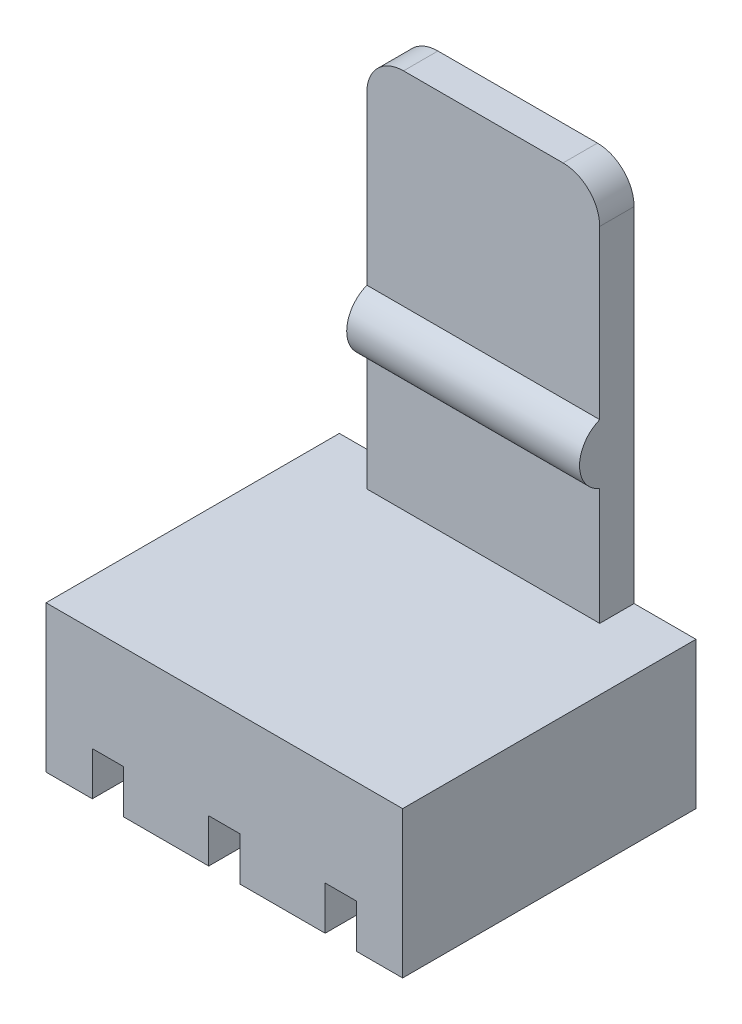
ISO-10303-21;
HEADER;
FILE_DESCRIPTION(('STEP AP214'),'2;1');
FILE_NAME('part.step','',(''),(''),'','','');
FILE_SCHEMA(('AUTOMOTIVE_DESIGN { 1 0 10303 214 1 1 1 1 }'));
ENDSEC;
DATA;
#1=APPLICATION_CONTEXT('core data for automotive mechanical design processes');
#2=APPLICATION_PROTOCOL_DEFINITION('international standard','automotive_design',2000,#1);
#3=PRODUCT_CONTEXT('',#1,'mechanical');
#4=PRODUCT('Part','Part','',(#3));
#5=PRODUCT_RELATED_PRODUCT_CATEGORY('part','',(#4));
#6=PRODUCT_DEFINITION_FORMATION('','',#4);
#7=PRODUCT_DEFINITION_CONTEXT('part definition',#1,'design');
#8=PRODUCT_DEFINITION('design','',#6,#7);
#9=PRODUCT_DEFINITION_SHAPE('','',#8);
#10=(LENGTH_UNIT() NAMED_UNIT(*) SI_UNIT(.MILLI.,.METRE.));
#11=(NAMED_UNIT(*) PLANE_ANGLE_UNIT() SI_UNIT($,.RADIAN.));
#12=(NAMED_UNIT(*) SI_UNIT($,.STERADIAN.) SOLID_ANGLE_UNIT());
#13=UNCERTAINTY_MEASURE_WITH_UNIT(LENGTH_MEASURE(1.E-05),#10,'distance_accuracy_value','');
#14=(GEOMETRIC_REPRESENTATION_CONTEXT(3) GLOBAL_UNCERTAINTY_ASSIGNED_CONTEXT((#13)) GLOBAL_UNIT_ASSIGNED_CONTEXT((#10,
#11,#12)) REPRESENTATION_CONTEXT('',''));
#15=CARTESIAN_POINT('',(0.,0.,0.));
#16=DIRECTION('',(0.,0.,1.));
#17=DIRECTION('',(1.,0.,0.));
#18=AXIS2_PLACEMENT_3D('',#15,#16,#17);
#19=CARTESIAN_POINT('',(-2.88,0.,-3.2));
#20=DIRECTION('',(-1.,0.,0.));
#21=DIRECTION('',(0.,0.,1.));
#22=AXIS2_PLACEMENT_3D('',#19,#20,#21);
#23=PLANE('',#22);
#24=DIRECTION('',(0.,1.,0.));
#25=VECTOR('',#24,1.);
#26=CARTESIAN_POINT('',(-2.88,0.,-3.2));
#27=LINE('',#26,#25);
#28=CARTESIAN_POINT('',(-2.88,0.95,-3.2));
#29=VERTEX_POINT('',#28);
#30=CARTESIAN_POINT('',(-2.88,0.,-3.2));
#31=VERTEX_POINT('',#30);
#32=EDGE_CURVE('E187',#29,#31,#27,.F.);
#33=ORIENTED_EDGE('',*,*,#32,.F.);
#34=DIRECTION('',(0.,0.,1.));
#35=VECTOR('',#34,1.);
#36=CARTESIAN_POINT('',(-2.88,0.95,0.));
#37=LINE('',#36,#35);
#38=CARTESIAN_POINT('',(-2.88,0.95,3.2));
#39=VERTEX_POINT('',#38);
#40=EDGE_CURVE('E290',#29,#39,#37,.T.);
#41=ORIENTED_EDGE('',*,*,#40,.T.);
#42=DIRECTION('',(0.,1.,0.));
#43=VECTOR('',#42,1.);
#44=CARTESIAN_POINT('',(-2.88,0.,3.2));
#45=LINE('',#44,#43);
#46=CARTESIAN_POINT('',(-2.88,0.,3.2));
#47=VERTEX_POINT('',#46);
#48=EDGE_CURVE('E333',#47,#39,#45,.T.);
#49=ORIENTED_EDGE('',*,*,#48,.F.);
#50=DIRECTION('',(0.,0.,1.));
#51=VECTOR('',#50,1.);
#52=CARTESIAN_POINT('',(-2.88,0.,0.));
#53=LINE('',#52,#51);
#54=EDGE_CURVE('E195',#47,#31,#53,.F.);
#55=ORIENTED_EDGE('',*,*,#54,.T.);
#56=EDGE_LOOP('',(#33,#41,#49,#55));
#57=FACE_BOUND('',#56,.T.);
#58=ADVANCED_FACE('F17',(#57),#23,.F.);
#59=CARTESIAN_POINT('',(1.27,6.4,-2.70980762113533));
#60=DIRECTION('',(1.,0.,0.));
#61=DIRECTION('',(0.,1.,0.));
#62=AXIS2_PLACEMENT_3D('',#59,#60,#61);
#63=CYLINDRICAL_SURFACE('',#62,0.7);
#64=CARTESIAN_POINT('',(2.54,6.4,-2.70980762113533));
#65=DIRECTION('',(1.,0.,0.));
#66=DIRECTION('',(0.,1.,0.));
#67=AXIS2_PLACEMENT_3D('',#64,#65,#66);
#68=CIRCLE('',#67,0.7);
#69=CARTESIAN_POINT('',(2.54,5.75,-2.45));
#70=VERTEX_POINT('',#69);
#71=CARTESIAN_POINT('',(2.54,7.05,-2.45));
#72=VERTEX_POINT('',#71);
#73=EDGE_CURVE('E186',#70,#72,#68,.F.);
#74=ORIENTED_EDGE('',*,*,#73,.T.);
#75=DIRECTION('',(1.,0.,0.));
#76=VECTOR('',#75,1.);
#77=CARTESIAN_POINT('',(0.,7.05,-2.45));
#78=LINE('',#77,#76);
#79=CARTESIAN_POINT('',(-2.54,7.05,-2.45));
#80=VERTEX_POINT('',#79);
#81=EDGE_CURVE('E184',#80,#72,#78,.T.);
#82=ORIENTED_EDGE('',*,*,#81,.F.);
#83=CARTESIAN_POINT('',(-2.54,6.4,-2.70980762113533));
#84=DIRECTION('',(1.,0.,0.));
#85=DIRECTION('',(0.,1.,0.));
#86=AXIS2_PLACEMENT_3D('',#83,#84,#85);
#87=CIRCLE('',#86,0.7);
#88=CARTESIAN_POINT('',(-2.54,5.75,-2.45));
#89=VERTEX_POINT('',#88);
#90=EDGE_CURVE('E20',#80,#89,#87,.T.);
#91=ORIENTED_EDGE('',*,*,#90,.T.);
#92=DIRECTION('',(1.,0.,0.));
#93=VECTOR('',#92,1.);
#94=CARTESIAN_POINT('',(0.,5.75,-2.45));
#95=LINE('',#94,#93);
#96=EDGE_CURVE('E181',#70,#89,#95,.F.);
#97=ORIENTED_EDGE('',*,*,#96,.F.);
#98=EDGE_LOOP('',(#74,#82,#91,#97));
#99=FACE_BOUND('',#98,.T.);
#100=ADVANCED_FACE('F180',(#99),#63,.T.);
#101=CARTESIAN_POINT('',(2.88,0.,3.2));
#102=DIRECTION('',(1.,0.,0.));
#103=DIRECTION('',(0.,0.,-1.));
#104=AXIS2_PLACEMENT_3D('',#101,#102,#103);
#105=PLANE('',#104);
#106=DIRECTION('',(0.,1.,0.));
#107=VECTOR('',#106,1.);
#108=CARTESIAN_POINT('',(2.88,0.,3.2));
#109=LINE('',#108,#107);
#110=CARTESIAN_POINT('',(2.88,0.95,3.2));
#111=VERTEX_POINT('',#110);
#112=CARTESIAN_POINT('',(2.88,0.,3.2));
#113=VERTEX_POINT('',#112);
#114=EDGE_CURVE('E304',#111,#113,#109,.F.);
#115=ORIENTED_EDGE('',*,*,#114,.F.);
#116=DIRECTION('',(0.,0.,1.));
#117=VECTOR('',#116,1.);
#118=CARTESIAN_POINT('',(2.88,0.95,0.));
#119=LINE('',#118,#117);
#120=CARTESIAN_POINT('',(2.88,0.95,-3.2));
#121=VERTEX_POINT('',#120);
#122=EDGE_CURVE('E297',#111,#121,#119,.F.);
#123=ORIENTED_EDGE('',*,*,#122,.T.);
#124=DIRECTION('',(0.,1.,0.));
#125=VECTOR('',#124,1.);
#126=CARTESIAN_POINT('',(2.88,0.,-3.2));
#127=LINE('',#126,#125);
#128=CARTESIAN_POINT('',(2.88,0.,-3.2));
#129=VERTEX_POINT('',#128);
#130=EDGE_CURVE('E330',#129,#121,#127,.T.);
#131=ORIENTED_EDGE('',*,*,#130,.F.);
#132=DIRECTION('',(0.,0.,1.));
#133=VECTOR('',#132,1.);
#134=CARTESIAN_POINT('',(2.88,0.,0.));
#135=LINE('',#134,#133);
#136=EDGE_CURVE('E264',#129,#113,#135,.T.);
#137=ORIENTED_EDGE('',*,*,#136,.T.);
#138=EDGE_LOOP('',(#115,#123,#131,#137));
#139=FACE_BOUND('',#138,.T.);
#140=ADVANCED_FACE('F416',(#139),#105,.F.);
#141=CARTESIAN_POINT('',(2.54,0.95,0.));
#142=DIRECTION('',(0.,1.,0.));
#143=DIRECTION('',(0.,0.,1.));
#144=AXIS2_PLACEMENT_3D('',#141,#142,#143);
#145=PLANE('',#144);
#146=DIRECTION('',(1.,0.,0.));
#147=VECTOR('',#146,1.);
#148=CARTESIAN_POINT('',(2.54,0.95,3.2));
#149=LINE('',#148,#147);
#150=CARTESIAN_POINT('',(2.2,0.95,3.2));
#151=VERTEX_POINT('',#150);
#152=EDGE_CURVE('E300',#151,#111,#149,.T.);
#153=ORIENTED_EDGE('',*,*,#152,.F.);
#154=DIRECTION('',(0.,0.,1.));
#155=VECTOR('',#154,1.);
#156=CARTESIAN_POINT('',(2.2,0.95,-3.2));
#157=LINE('',#156,#155);
#158=CARTESIAN_POINT('',(2.2,0.95,-3.2));
#159=VERTEX_POINT('',#158);
#160=EDGE_CURVE('E260',#151,#159,#157,.F.);
#161=ORIENTED_EDGE('',*,*,#160,.T.);
#162=DIRECTION('',(1.,0.,0.));
#163=VECTOR('',#162,1.);
#164=CARTESIAN_POINT('',(2.54,0.95,-3.2));
#165=LINE('',#164,#163);
#166=EDGE_CURVE('E302',#121,#159,#165,.F.);
#167=ORIENTED_EDGE('',*,*,#166,.F.);
#168=ORIENTED_EDGE('',*,*,#122,.F.);
#169=EDGE_LOOP('',(#153,#161,#167,#168));
#170=FACE_BOUND('',#169,.T.);
#171=ADVANCED_FACE('F420',(#170),#145,.F.);
#172=CARTESIAN_POINT('',(0.,0.95,0.));
#173=DIRECTION('',(0.,1.,0.));
#174=DIRECTION('',(0.,0.,1.));
#175=AXIS2_PLACEMENT_3D('',#172,#173,#174);
#176=PLANE('',#175);
#177=DIRECTION('',(0.,0.,-1.));
#178=VECTOR('',#177,1.);
#179=CARTESIAN_POINT('',(0.34,0.95,3.2));
#180=LINE('',#179,#178);
#181=CARTESIAN_POINT('',(0.34,0.95,-3.2));
#182=VERTEX_POINT('',#181);
#183=CARTESIAN_POINT('',(0.34,0.95,3.2));
#184=VERTEX_POINT('',#183);
#185=EDGE_CURVE('E254',#182,#184,#180,.F.);
#186=ORIENTED_EDGE('',*,*,#185,.T.);
#187=DIRECTION('',(1.,0.,0.));
#188=VECTOR('',#187,1.);
#189=CARTESIAN_POINT('',(-3.89,0.95,3.2));
#190=LINE('',#189,#188);
#191=CARTESIAN_POINT('',(-0.34,0.95,3.2));
#192=VERTEX_POINT('',#191);
#193=EDGE_CURVE('E248',#192,#184,#190,.T.);
#194=ORIENTED_EDGE('',*,*,#193,.F.);
#195=DIRECTION('',(0.,0.,1.));
#196=VECTOR('',#195,1.);
#197=CARTESIAN_POINT('',(-0.34,0.95,-3.2));
#198=LINE('',#197,#196);
#199=CARTESIAN_POINT('',(-0.34,0.95,-3.2));
#200=VERTEX_POINT('',#199);
#201=EDGE_CURVE('E229',#192,#200,#198,.F.);
#202=ORIENTED_EDGE('',*,*,#201,.T.);
#203=DIRECTION('',(1.,0.,0.));
#204=VECTOR('',#203,1.);
#205=CARTESIAN_POINT('',(0.,0.95,-3.2));
#206=LINE('',#205,#204);
#207=EDGE_CURVE('E295',#182,#200,#206,.F.);
#208=ORIENTED_EDGE('',*,*,#207,.F.);
#209=EDGE_LOOP('',(#186,#194,#202,#208));
#210=FACE_BOUND('',#209,.T.);
#211=ADVANCED_FACE('F470',(#210),#176,.F.);
#212=CARTESIAN_POINT('',(-2.54,0.95,0.));
#213=DIRECTION('',(0.,1.,0.));
#214=DIRECTION('',(0.,0.,1.));
#215=AXIS2_PLACEMENT_3D('',#212,#213,#214);
#216=PLANE('',#215);
#217=DIRECTION('',(1.,0.,0.));
#218=VECTOR('',#217,1.);
#219=CARTESIAN_POINT('',(-2.54,0.95,-3.2));
#220=LINE('',#219,#218);
#221=CARTESIAN_POINT('',(-2.2,0.95,-3.2));
#222=VERTEX_POINT('',#221);
#223=EDGE_CURVE('E293',#222,#29,#220,.F.);
#224=ORIENTED_EDGE('',*,*,#223,.F.);
#225=DIRECTION('',(0.,0.,-1.));
#226=VECTOR('',#225,1.);
#227=CARTESIAN_POINT('',(-2.2,0.95,3.2));
#228=LINE('',#227,#226);
#229=CARTESIAN_POINT('',(-2.2,0.95,3.2));
#230=VERTEX_POINT('',#229);
#231=EDGE_CURVE('E224',#222,#230,#228,.F.);
#232=ORIENTED_EDGE('',*,*,#231,.T.);
#233=DIRECTION('',(1.,0.,0.));
#234=VECTOR('',#233,1.);
#235=CARTESIAN_POINT('',(-3.89,0.95,3.2));
#236=LINE('',#235,#234);
#237=EDGE_CURVE('E251',#39,#230,#236,.T.);
#238=ORIENTED_EDGE('',*,*,#237,.F.);
#239=ORIENTED_EDGE('',*,*,#40,.F.);
#240=EDGE_LOOP('',(#224,#232,#238,#239));
#241=FACE_BOUND('',#240,.T.);
#242=ADVANCED_FACE('F455',(#241),#216,.F.);
#243=CARTESIAN_POINT('',(0.,0.,0.));
#244=DIRECTION('',(0.,1.,0.));
#245=DIRECTION('',(0.,0.,1.));
#246=AXIS2_PLACEMENT_3D('',#243,#244,#245);
#247=PLANE('',#246);
#248=DIRECTION('',(1.,0.,0.));
#249=VECTOR('',#248,1.);
#250=CARTESIAN_POINT('',(-3.89,0.,3.2));
#251=LINE('',#250,#249);
#252=CARTESIAN_POINT('',(-3.89,0.,3.2));
#253=VERTEX_POINT('',#252);
#254=EDGE_CURVE('E235',#253,#47,#251,.T.);
#255=ORIENTED_EDGE('',*,*,#254,.F.);
#256=DIRECTION('',(0.,0.,1.));
#257=VECTOR('',#256,1.);
#258=CARTESIAN_POINT('',(-3.89,0.,-3.2));
#259=LINE('',#258,#257);
#260=CARTESIAN_POINT('',(-3.89,0.,-3.2));
#261=VERTEX_POINT('',#260);
#262=EDGE_CURVE('E219',#261,#253,#259,.T.);
#263=ORIENTED_EDGE('',*,*,#262,.F.);
#264=DIRECTION('',(1.,0.,0.));
#265=VECTOR('',#264,1.);
#266=CARTESIAN_POINT('',(0.,0.,-3.2));
#267=LINE('',#266,#265);
#268=EDGE_CURVE('E288',#31,#261,#267,.F.);
#269=ORIENTED_EDGE('',*,*,#268,.F.);
#270=ORIENTED_EDGE('',*,*,#54,.F.);
#271=EDGE_LOOP('',(#255,#263,#269,#270));
#272=FACE_BOUND('',#271,.T.);
#273=ADVANCED_FACE('F447',(#272),#247,.F.);
#274=CARTESIAN_POINT('',(0.,7.35,-2.45));
#275=DIRECTION('',(0.,0.,1.));
#276=DIRECTION('',(1.,0.,0.));
#277=AXIS2_PLACEMENT_3D('',#274,#275,#276);
#278=PLANE('',#277);
#279=DIRECTION('',(1.,0.,0.));
#280=VECTOR('',#279,1.);
#281=CARTESIAN_POINT('',(0.,3.2,-2.45));
#282=LINE('',#281,#280);
#283=CARTESIAN_POINT('',(2.54,3.2,-2.45));
#284=VERTEX_POINT('',#283);
#285=CARTESIAN_POINT('',(-2.54,3.2,-2.45));
#286=VERTEX_POINT('',#285);
#287=EDGE_CURVE('E263',#284,#286,#282,.F.);
#288=ORIENTED_EDGE('',*,*,#287,.F.);
#289=DIRECTION('',(0.,1.,0.));
#290=VECTOR('',#289,1.);
#291=CARTESIAN_POINT('',(2.54,3.2,-2.45));
#292=LINE('',#291,#290);
#293=EDGE_CURVE('E194',#70,#284,#292,.F.);
#294=ORIENTED_EDGE('',*,*,#293,.F.);
#295=ORIENTED_EDGE('',*,*,#96,.T.);
#296=DIRECTION('',(0.,1.,0.));
#297=VECTOR('',#296,1.);
#298=CARTESIAN_POINT('',(-2.54,11.5,-2.45));
#299=LINE('',#298,#297);
#300=EDGE_CURVE('E191',#286,#89,#299,.T.);
#301=ORIENTED_EDGE('',*,*,#300,.F.);
#302=EDGE_LOOP('',(#288,#294,#295,#301));
#303=FACE_BOUND('',#302,.T.);
#304=ADVANCED_FACE('F190',(#303),#278,.T.);
#305=CARTESIAN_POINT('',(0.,7.35,-2.45));
#306=DIRECTION('',(0.,0.,1.));
#307=DIRECTION('',(1.,0.,0.));
#308=AXIS2_PLACEMENT_3D('',#305,#306,#307);
#309=PLANE('',#308);
#310=CARTESIAN_POINT('',(-1.74,10.7,-2.45));
#311=DIRECTION('',(0.,0.,1.));
#312=DIRECTION('',(1.,0.,0.));
#313=AXIS2_PLACEMENT_3D('',#310,#311,#312);
#314=CIRCLE('',#313,0.8);
#315=CARTESIAN_POINT('',(-2.54,10.7,-2.45));
#316=VERTEX_POINT('',#315);
#317=CARTESIAN_POINT('',(-1.74,11.5,-2.45));
#318=VERTEX_POINT('',#317);
#319=EDGE_CURVE('E201',#316,#318,#314,.F.);
#320=ORIENTED_EDGE('',*,*,#319,.F.);
#321=DIRECTION('',(0.,1.,0.));
#322=VECTOR('',#321,1.);
#323=CARTESIAN_POINT('',(-2.54,11.5,-2.45));
#324=LINE('',#323,#322);
#325=EDGE_CURVE('E205',#80,#316,#324,.T.);
#326=ORIENTED_EDGE('',*,*,#325,.F.);
#327=ORIENTED_EDGE('',*,*,#81,.T.);
#328=DIRECTION('',(0.,1.,0.));
#329=VECTOR('',#328,1.);
#330=CARTESIAN_POINT('',(2.54,3.2,-2.45));
#331=LINE('',#330,#329);
#332=CARTESIAN_POINT('',(2.54,10.7,-2.45));
#333=VERTEX_POINT('',#332);
#334=EDGE_CURVE('E348',#333,#72,#331,.F.);
#335=ORIENTED_EDGE('',*,*,#334,.F.);
#336=CARTESIAN_POINT('',(1.74,10.7,-2.45));
#337=DIRECTION('',(0.,0.,1.));
#338=DIRECTION('',(1.,0.,0.));
#339=AXIS2_PLACEMENT_3D('',#336,#337,#338);
#340=CIRCLE('',#339,0.8);
#341=CARTESIAN_POINT('',(1.74,11.5,-2.45));
#342=VERTEX_POINT('',#341);
#343=EDGE_CURVE('E281',#342,#333,#340,.F.);
#344=ORIENTED_EDGE('',*,*,#343,.F.);
#345=DIRECTION('',(1.,0.,0.));
#346=VECTOR('',#345,1.);
#347=CARTESIAN_POINT('',(2.54,11.5,-2.45));
#348=LINE('',#347,#346);
#349=EDGE_CURVE('E278',#318,#342,#348,.T.);
#350=ORIENTED_EDGE('',*,*,#349,.F.);
#351=EDGE_LOOP('',(#320,#326,#327,#335,#344,#350));
#352=FACE_BOUND('',#351,.T.);
#353=ADVANCED_FACE('F347',(#352),#309,.T.);
#354=CARTESIAN_POINT('',(0.,0.,0.));
#355=DIRECTION('',(0.,1.,0.));
#356=DIRECTION('',(0.,0.,1.));
#357=AXIS2_PLACEMENT_3D('',#354,#355,#356);
#358=PLANE('',#357);
#359=DIRECTION('',(1.,0.,0.));
#360=VECTOR('',#359,1.);
#361=CARTESIAN_POINT('',(0.,0.,-3.2));
#362=LINE('',#361,#360);
#363=CARTESIAN_POINT('',(3.89,0.,-3.2));
#364=VERTEX_POINT('',#363);
#365=EDGE_CURVE('E268',#364,#129,#362,.F.);
#366=ORIENTED_EDGE('',*,*,#365,.F.);
#367=DIRECTION('',(0.,0.,-1.));
#368=VECTOR('',#367,1.);
#369=CARTESIAN_POINT('',(3.89,0.,3.2));
#370=LINE('',#369,#368);
#371=CARTESIAN_POINT('',(3.89,0.,3.2));
#372=VERTEX_POINT('',#371);
#373=EDGE_CURVE('E309',#372,#364,#370,.T.);
#374=ORIENTED_EDGE('',*,*,#373,.F.);
#375=DIRECTION('',(1.,0.,0.));
#376=VECTOR('',#375,1.);
#377=CARTESIAN_POINT('',(-3.89,0.,3.2));
#378=LINE('',#377,#376);
#379=EDGE_CURVE('E240',#113,#372,#378,.T.);
#380=ORIENTED_EDGE('',*,*,#379,.F.);
#381=ORIENTED_EDGE('',*,*,#136,.F.);
#382=EDGE_LOOP('',(#366,#374,#380,#381));
#383=FACE_BOUND('',#382,.T.);
#384=ADVANCED_FACE('F412',(#383),#358,.F.);
#385=CARTESIAN_POINT('',(0.,3.2,0.));
#386=DIRECTION('',(0.,1.,0.));
#387=DIRECTION('',(0.,0.,1.));
#388=AXIS2_PLACEMENT_3D('',#385,#386,#387);
#389=PLANE('',#388);
#390=DIRECTION('',(0.,0.,-1.));
#391=VECTOR('',#390,1.);
#392=CARTESIAN_POINT('',(2.54,3.2,-3.2));
#393=LINE('',#392,#391);
#394=CARTESIAN_POINT('',(2.54,3.2,-3.2));
#395=VERTEX_POINT('',#394);
#396=EDGE_CURVE('E356',#284,#395,#393,.T.);
#397=ORIENTED_EDGE('',*,*,#396,.F.);
#398=ORIENTED_EDGE('',*,*,#287,.T.);
#399=DIRECTION('',(0.,0.,1.));
#400=VECTOR('',#399,1.);
#401=CARTESIAN_POINT('',(-2.54,3.2,-3.2));
#402=LINE('',#401,#400);
#403=CARTESIAN_POINT('',(-2.54,3.2,-3.2));
#404=VERTEX_POINT('',#403);
#405=EDGE_CURVE('E200',#404,#286,#402,.T.);
#406=ORIENTED_EDGE('',*,*,#405,.F.);
#407=DIRECTION('',(1.,0.,0.));
#408=VECTOR('',#407,1.);
#409=CARTESIAN_POINT('',(0.,3.2,-3.2));
#410=LINE('',#409,#408);
#411=CARTESIAN_POINT('',(-3.89,3.2,-3.2));
#412=VERTEX_POINT('',#411);
#413=EDGE_CURVE('E267',#404,#412,#410,.F.);
#414=ORIENTED_EDGE('',*,*,#413,.T.);
#415=DIRECTION('',(0.,0.,1.));
#416=VECTOR('',#415,1.);
#417=CARTESIAN_POINT('',(-3.89,3.2,-3.2));
#418=LINE('',#417,#416);
#419=CARTESIAN_POINT('',(-3.89,3.2,3.2));
#420=VERTEX_POINT('',#419);
#421=EDGE_CURVE('E212',#420,#412,#418,.F.);
#422=ORIENTED_EDGE('',*,*,#421,.F.);
#423=DIRECTION('',(1.,0.,0.));
#424=VECTOR('',#423,1.);
#425=CARTESIAN_POINT('',(-3.89,3.2,3.2));
#426=LINE('',#425,#424);
#427=CARTESIAN_POINT('',(3.89,3.2,3.2));
#428=VERTEX_POINT('',#427);
#429=EDGE_CURVE('E238',#428,#420,#426,.F.);
#430=ORIENTED_EDGE('',*,*,#429,.F.);
#431=DIRECTION('',(0.,0.,-1.));
#432=VECTOR('',#431,1.);
#433=CARTESIAN_POINT('',(3.89,3.2,3.2));
#434=LINE('',#433,#432);
#435=CARTESIAN_POINT('',(3.89,3.2,-3.2));
#436=VERTEX_POINT('',#435);
#437=EDGE_CURVE('E305',#436,#428,#434,.F.);
#438=ORIENTED_EDGE('',*,*,#437,.F.);
#439=DIRECTION('',(1.,0.,0.));
#440=VECTOR('',#439,1.);
#441=CARTESIAN_POINT('',(0.,3.2,-3.2));
#442=LINE('',#441,#440);
#443=EDGE_CURVE('E271',#436,#395,#442,.F.);
#444=ORIENTED_EDGE('',*,*,#443,.T.);
#445=EDGE_LOOP('',(#397,#398,#406,#414,#422,#430,#438,#444));
#446=FACE_BOUND('',#445,.T.);
#447=ADVANCED_FACE('F440',(#446),#389,.T.);
#448=CARTESIAN_POINT('',(2.2,0.,-3.2));
#449=DIRECTION('',(-1.,0.,0.));
#450=DIRECTION('',(0.,0.,1.));
#451=AXIS2_PLACEMENT_3D('',#448,#449,#450);
#452=PLANE('',#451);
#453=DIRECTION('',(0.,1.,0.));
#454=VECTOR('',#453,1.);
#455=CARTESIAN_POINT('',(2.2,0.,-3.2));
#456=LINE('',#455,#454);
#457=CARTESIAN_POINT('',(2.2,0.,-3.2));
#458=VERTEX_POINT('',#457);
#459=EDGE_CURVE('E258',#159,#458,#456,.F.);
#460=ORIENTED_EDGE('',*,*,#459,.F.);
#461=ORIENTED_EDGE('',*,*,#160,.F.);
#462=DIRECTION('',(0.,1.,0.));
#463=VECTOR('',#462,1.);
#464=CARTESIAN_POINT('',(2.2,0.,3.2));
#465=LINE('',#464,#463);
#466=CARTESIAN_POINT('',(2.2,0.,3.2));
#467=VERTEX_POINT('',#466);
#468=EDGE_CURVE('E243',#467,#151,#465,.T.);
#469=ORIENTED_EDGE('',*,*,#468,.F.);
#470=DIRECTION('',(0.,0.,1.));
#471=VECTOR('',#470,1.);
#472=CARTESIAN_POINT('',(2.2,0.,0.));
#473=LINE('',#472,#471);
#474=EDGE_CURVE('E393',#467,#458,#473,.F.);
#475=ORIENTED_EDGE('',*,*,#474,.T.);
#476=EDGE_LOOP('',(#460,#461,#469,#475));
#477=FACE_BOUND('',#476,.T.);
#478=ADVANCED_FACE('F427',(#477),#452,.F.);
#479=CARTESIAN_POINT('',(0.34,0.,3.2));
#480=DIRECTION('',(1.,0.,0.));
#481=DIRECTION('',(0.,0.,-1.));
#482=AXIS2_PLACEMENT_3D('',#479,#480,#481);
#483=PLANE('',#482);
#484=DIRECTION('',(0.,1.,0.));
#485=VECTOR('',#484,1.);
#486=CARTESIAN_POINT('',(0.34,0.,3.2));
#487=LINE('',#486,#485);
#488=CARTESIAN_POINT('',(0.34,0.,3.2));
#489=VERTEX_POINT('',#488);
#490=EDGE_CURVE('E246',#184,#489,#487,.F.);
#491=ORIENTED_EDGE('',*,*,#490,.F.);
#492=ORIENTED_EDGE('',*,*,#185,.F.);
#493=DIRECTION('',(0.,1.,0.));
#494=VECTOR('',#493,1.);
#495=CARTESIAN_POINT('',(0.34,0.,-3.2));
#496=LINE('',#495,#494);
#497=CARTESIAN_POINT('',(0.34,0.,-3.2));
#498=VERTEX_POINT('',#497);
#499=EDGE_CURVE('E256',#498,#182,#496,.T.);
#500=ORIENTED_EDGE('',*,*,#499,.F.);
#501=DIRECTION('',(0.,0.,1.));
#502=VECTOR('',#501,1.);
#503=CARTESIAN_POINT('',(0.34,0.,0.));
#504=LINE('',#503,#502);
#505=EDGE_CURVE('E390',#498,#489,#504,.T.);
#506=ORIENTED_EDGE('',*,*,#505,.T.);
#507=EDGE_LOOP('',(#491,#492,#500,#506));
#508=FACE_BOUND('',#507,.T.);
#509=ADVANCED_FACE('F474',(#508),#483,.F.);
#510=CARTESIAN_POINT('',(-3.89,0.,3.2));
#511=DIRECTION('',(0.,0.,1.));
#512=DIRECTION('',(1.,0.,0.));
#513=AXIS2_PLACEMENT_3D('',#510,#511,#512);
#514=PLANE('',#513);
#515=DIRECTION('',(0.,1.,0.));
#516=VECTOR('',#515,1.);
#517=CARTESIAN_POINT('',(-3.89,0.,3.2));
#518=LINE('',#517,#516);
#519=EDGE_CURVE('E216',#253,#420,#518,.T.);
#520=ORIENTED_EDGE('',*,*,#519,.F.);
#521=ORIENTED_EDGE('',*,*,#254,.T.);
#522=ORIENTED_EDGE('',*,*,#48,.T.);
#523=ORIENTED_EDGE('',*,*,#237,.T.);
#524=DIRECTION('',(0.,1.,0.));
#525=VECTOR('',#524,1.);
#526=CARTESIAN_POINT('',(-2.2,0.,3.2));
#527=LINE('',#526,#525);
#528=CARTESIAN_POINT('',(-2.2,0.,3.2));
#529=VERTEX_POINT('',#528);
#530=EDGE_CURVE('E222',#230,#529,#527,.F.);
#531=ORIENTED_EDGE('',*,*,#530,.T.);
#532=DIRECTION('',(1.,0.,0.));
#533=VECTOR('',#532,1.);
#534=CARTESIAN_POINT('',(0.,0.,3.2));
#535=LINE('',#534,#533);
#536=CARTESIAN_POINT('',(-0.34,0.,3.2));
#537=VERTEX_POINT('',#536);
#538=EDGE_CURVE('E388',#529,#537,#535,.T.);
#539=ORIENTED_EDGE('',*,*,#538,.T.);
#540=DIRECTION('',(0.,1.,0.));
#541=VECTOR('',#540,1.);
#542=CARTESIAN_POINT('',(-0.34,0.,3.2));
#543=LINE('',#542,#541);
#544=EDGE_CURVE('E232',#537,#192,#543,.T.);
#545=ORIENTED_EDGE('',*,*,#544,.T.);
#546=ORIENTED_EDGE('',*,*,#193,.T.);
#547=ORIENTED_EDGE('',*,*,#490,.T.);
#548=DIRECTION('',(1.,0.,0.));
#549=VECTOR('',#548,1.);
#550=CARTESIAN_POINT('',(0.,0.,3.2));
#551=LINE('',#550,#549);
#552=EDGE_CURVE('E396',#489,#467,#551,.T.);
#553=ORIENTED_EDGE('',*,*,#552,.T.);
#554=ORIENTED_EDGE('',*,*,#468,.T.);
#555=ORIENTED_EDGE('',*,*,#152,.T.);
#556=ORIENTED_EDGE('',*,*,#114,.T.);
#557=ORIENTED_EDGE('',*,*,#379,.T.);
#558=DIRECTION('',(0.,1.,0.));
#559=VECTOR('',#558,1.);
#560=CARTESIAN_POINT('',(3.89,0.,3.2));
#561=LINE('',#560,#559);
#562=EDGE_CURVE('E308',#428,#372,#561,.F.);
#563=ORIENTED_EDGE('',*,*,#562,.F.);
#564=ORIENTED_EDGE('',*,*,#429,.T.);
#565=EDGE_LOOP('',(#520,#521,#522,#523,#531,#539,#545,#546,#547,#553,#554,#555,#556,#557,#563,#564));
#566=FACE_BOUND('',#565,.T.);
#567=ADVANCED_FACE('F406',(#566),#514,.T.);
#568=CARTESIAN_POINT('',(-0.34,0.,-3.2));
#569=DIRECTION('',(-1.,0.,0.));
#570=DIRECTION('',(0.,0.,1.));
#571=AXIS2_PLACEMENT_3D('',#568,#569,#570);
#572=PLANE('',#571);
#573=DIRECTION('',(0.,1.,0.));
#574=VECTOR('',#573,1.);
#575=CARTESIAN_POINT('',(-0.34,0.,-3.2));
#576=LINE('',#575,#574);
#577=CARTESIAN_POINT('',(-0.34,0.,-3.2));
#578=VERTEX_POINT('',#577);
#579=EDGE_CURVE('E227',#200,#578,#576,.F.);
#580=ORIENTED_EDGE('',*,*,#579,.F.);
#581=ORIENTED_EDGE('',*,*,#201,.F.);
#582=ORIENTED_EDGE('',*,*,#544,.F.);
#583=DIRECTION('',(0.,0.,1.));
#584=VECTOR('',#583,1.);
#585=CARTESIAN_POINT('',(-0.34,0.,0.));
#586=LINE('',#585,#584);
#587=EDGE_CURVE('E385',#537,#578,#586,.F.);
#588=ORIENTED_EDGE('',*,*,#587,.T.);
#589=EDGE_LOOP('',(#580,#581,#582,#588));
#590=FACE_BOUND('',#589,.T.);
#591=ADVANCED_FACE('F467',(#590),#572,.F.);
#592=CARTESIAN_POINT('',(-2.2,0.,3.2));
#593=DIRECTION('',(1.,0.,0.));
#594=DIRECTION('',(0.,0.,-1.));
#595=AXIS2_PLACEMENT_3D('',#592,#593,#594);
#596=PLANE('',#595);
#597=ORIENTED_EDGE('',*,*,#530,.F.);
#598=ORIENTED_EDGE('',*,*,#231,.F.);
#599=DIRECTION('',(0.,1.,0.));
#600=VECTOR('',#599,1.);
#601=CARTESIAN_POINT('',(-2.2,0.,-3.2));
#602=LINE('',#601,#600);
#603=CARTESIAN_POINT('',(-2.2,0.,-3.2));
#604=VERTEX_POINT('',#603);
#605=EDGE_CURVE('E35',#604,#222,#602,.T.);
#606=ORIENTED_EDGE('',*,*,#605,.F.);
#607=DIRECTION('',(0.,0.,1.));
#608=VECTOR('',#607,1.);
#609=CARTESIAN_POINT('',(-2.2,0.,0.));
#610=LINE('',#609,#608);
#611=EDGE_CURVE('E326',#604,#529,#610,.T.);
#612=ORIENTED_EDGE('',*,*,#611,.T.);
#613=EDGE_LOOP('',(#597,#598,#606,#612));
#614=FACE_BOUND('',#613,.T.);
#615=ADVANCED_FACE('F457',(#614),#596,.F.);
#616=CARTESIAN_POINT('',(-3.89,0.,-3.2));
#617=DIRECTION('',(-1.,0.,0.));
#618=DIRECTION('',(0.,0.,1.));
#619=AXIS2_PLACEMENT_3D('',#616,#617,#618);
#620=PLANE('',#619);
#621=ORIENTED_EDGE('',*,*,#421,.T.);
#622=DIRECTION('',(0.,1.,0.));
#623=VECTOR('',#622,1.);
#624=CARTESIAN_POINT('',(-3.89,0.,-3.2));
#625=LINE('',#624,#623);
#626=EDGE_CURVE('E322',#261,#412,#625,.T.);
#627=ORIENTED_EDGE('',*,*,#626,.F.);
#628=ORIENTED_EDGE('',*,*,#262,.T.);
#629=ORIENTED_EDGE('',*,*,#519,.T.);
#630=EDGE_LOOP('',(#621,#627,#628,#629));
#631=FACE_BOUND('',#630,.T.);
#632=ADVANCED_FACE('F443',(#631),#620,.T.);
#633=CARTESIAN_POINT('',(-2.54,11.5,-3.2));
#634=DIRECTION('',(-1.,0.,0.));
#635=DIRECTION('',(0.,0.,1.));
#636=AXIS2_PLACEMENT_3D('',#633,#634,#635);
#637=PLANE('',#636);
#638=ORIENTED_EDGE('',*,*,#405,.T.);
#639=ORIENTED_EDGE('',*,*,#300,.T.);
#640=ORIENTED_EDGE('',*,*,#90,.F.);
#641=ORIENTED_EDGE('',*,*,#325,.T.);
#642=DIRECTION('',(0.,0.,1.));
#643=VECTOR('',#642,1.);
#644=CARTESIAN_POINT('',(-2.54,10.7,-3.2));
#645=LINE('',#644,#643);
#646=CARTESIAN_POINT('',(-2.54,10.7,-3.2));
#647=VERTEX_POINT('',#646);
#648=EDGE_CURVE('E203',#647,#316,#645,.T.);
#649=ORIENTED_EDGE('',*,*,#648,.F.);
#650=DIRECTION('',(0.,1.,0.));
#651=VECTOR('',#650,1.);
#652=CARTESIAN_POINT('',(-2.54,0.,-3.2));
#653=LINE('',#652,#651);
#654=EDGE_CURVE('E325',#404,#647,#653,.T.);
#655=ORIENTED_EDGE('',*,*,#654,.F.);
#656=EDGE_LOOP('',(#638,#639,#640,#641,#649,#655));
#657=FACE_BOUND('',#656,.T.);
#658=ADVANCED_FACE('F197',(#657),#637,.T.);
#659=CARTESIAN_POINT('',(-1.74,10.7,-3.2));
#660=DIRECTION('',(0.,0.,1.));
#661=DIRECTION('',(1.,0.,0.));
#662=AXIS2_PLACEMENT_3D('',#659,#660,#661);
#663=CYLINDRICAL_SURFACE('',#662,0.8);
#664=CARTESIAN_POINT('',(-1.74,10.7,-3.2));
#665=DIRECTION('',(0.,0.,1.));
#666=DIRECTION('',(1.,0.,0.));
#667=AXIS2_PLACEMENT_3D('',#664,#665,#666);
#668=CIRCLE('',#667,0.8);
#669=CARTESIAN_POINT('',(-1.74,11.5,-3.2));
#670=VERTEX_POINT('',#669);
#671=EDGE_CURVE('E339',#647,#670,#668,.F.);
#672=ORIENTED_EDGE('',*,*,#671,.F.);
#673=ORIENTED_EDGE('',*,*,#648,.T.);
#674=ORIENTED_EDGE('',*,*,#319,.T.);
#675=DIRECTION('',(0.,0.,1.));
#676=VECTOR('',#675,1.);
#677=CARTESIAN_POINT('',(-1.74,11.5,-3.2));
#678=LINE('',#677,#676);
#679=EDGE_CURVE('E282',#670,#318,#678,.T.);
#680=ORIENTED_EDGE('',*,*,#679,.F.);
#681=EDGE_LOOP('',(#672,#673,#674,#680));
#682=FACE_BOUND('',#681,.T.);
#683=ADVANCED_FACE('F374',(#682),#663,.T.);
#684=CARTESIAN_POINT('',(2.54,11.5,-3.2));
#685=DIRECTION('',(0.,1.,0.));
#686=DIRECTION('',(0.,0.,1.));
#687=AXIS2_PLACEMENT_3D('',#684,#685,#686);
#688=PLANE('',#687);
#689=DIRECTION('',(0.,0.,1.));
#690=VECTOR('',#689,1.);
#691=CARTESIAN_POINT('',(1.74,11.5,-3.2));
#692=LINE('',#691,#690);
#693=CARTESIAN_POINT('',(1.74,11.5,-3.2));
#694=VERTEX_POINT('',#693);
#695=EDGE_CURVE('E342',#694,#342,#692,.T.);
#696=ORIENTED_EDGE('',*,*,#695,.F.);
#697=DIRECTION('',(-1.,0.,0.));
#698=VECTOR('',#697,1.);
#699=CARTESIAN_POINT('',(3.89,11.5,-3.2));
#700=LINE('',#699,#698);
#701=EDGE_CURVE('E338',#670,#694,#700,.F.);
#702=ORIENTED_EDGE('',*,*,#701,.F.);
#703=ORIENTED_EDGE('',*,*,#679,.T.);
#704=ORIENTED_EDGE('',*,*,#349,.T.);
#705=EDGE_LOOP('',(#696,#702,#703,#704));
#706=FACE_BOUND('',#705,.T.);
#707=ADVANCED_FACE('F500',(#706),#688,.T.);
#708=CARTESIAN_POINT('',(1.74,10.7,-3.2));
#709=DIRECTION('',(0.,0.,1.));
#710=DIRECTION('',(1.,0.,0.));
#711=AXIS2_PLACEMENT_3D('',#708,#709,#710);
#712=CYLINDRICAL_SURFACE('',#711,0.8);
#713=CARTESIAN_POINT('',(1.74,10.7,-3.2));
#714=DIRECTION('',(0.,0.,1.));
#715=DIRECTION('',(1.,0.,0.));
#716=AXIS2_PLACEMENT_3D('',#713,#714,#715);
#717=CIRCLE('',#716,0.8);
#718=CARTESIAN_POINT('',(2.54,10.7,-3.2));
#719=VERTEX_POINT('',#718);
#720=EDGE_CURVE('E335',#694,#719,#717,.F.);
#721=ORIENTED_EDGE('',*,*,#720,.F.);
#722=ORIENTED_EDGE('',*,*,#695,.T.);
#723=ORIENTED_EDGE('',*,*,#343,.T.);
#724=DIRECTION('',(0.,0.,-1.));
#725=VECTOR('',#724,1.);
#726=CARTESIAN_POINT('',(2.54,10.7,-3.2));
#727=LINE('',#726,#725);
#728=EDGE_CURVE('E352',#719,#333,#727,.F.);
#729=ORIENTED_EDGE('',*,*,#728,.F.);
#730=EDGE_LOOP('',(#721,#722,#723,#729));
#731=FACE_BOUND('',#730,.T.);
#732=ADVANCED_FACE('F497',(#731),#712,.T.);
#733=CARTESIAN_POINT('',(2.54,3.2,-3.2));
#734=DIRECTION('',(1.,0.,0.));
#735=DIRECTION('',(0.,0.,-1.));
#736=AXIS2_PLACEMENT_3D('',#733,#734,#735);
#737=PLANE('',#736);
#738=ORIENTED_EDGE('',*,*,#728,.T.);
#739=ORIENTED_EDGE('',*,*,#334,.T.);
#740=ORIENTED_EDGE('',*,*,#73,.F.);
#741=ORIENTED_EDGE('',*,*,#293,.T.);
#742=ORIENTED_EDGE('',*,*,#396,.T.);
#743=DIRECTION('',(0.,1.,0.));
#744=VECTOR('',#743,1.);
#745=CARTESIAN_POINT('',(2.54,0.,-3.2));
#746=LINE('',#745,#744);
#747=EDGE_CURVE('E315',#719,#395,#746,.F.);
#748=ORIENTED_EDGE('',*,*,#747,.F.);
#749=EDGE_LOOP('',(#738,#739,#740,#741,#742,#748));
#750=FACE_BOUND('',#749,.T.);
#751=ADVANCED_FACE('F350',(#750),#737,.T.);
#752=CARTESIAN_POINT('',(3.89,0.,3.2));
#753=DIRECTION('',(1.,0.,0.));
#754=DIRECTION('',(0.,0.,-1.));
#755=AXIS2_PLACEMENT_3D('',#752,#753,#754);
#756=PLANE('',#755);
#757=ORIENTED_EDGE('',*,*,#437,.T.);
#758=ORIENTED_EDGE('',*,*,#562,.T.);
#759=ORIENTED_EDGE('',*,*,#373,.T.);
#760=DIRECTION('',(0.,1.,0.));
#761=VECTOR('',#760,1.);
#762=CARTESIAN_POINT('',(3.89,0.,-3.2));
#763=LINE('',#762,#761);
#764=EDGE_CURVE('E312',#436,#364,#763,.F.);
#765=ORIENTED_EDGE('',*,*,#764,.F.);
#766=EDGE_LOOP('',(#757,#758,#759,#765));
#767=FACE_BOUND('',#766,.T.);
#768=ADVANCED_FACE('F401',(#767),#756,.T.);
#769=CARTESIAN_POINT('',(0.,0.,0.));
#770=DIRECTION('',(0.,1.,0.));
#771=DIRECTION('',(0.,0.,1.));
#772=AXIS2_PLACEMENT_3D('',#769,#770,#771);
#773=PLANE('',#772);
#774=DIRECTION('',(-1.,0.,0.));
#775=VECTOR('',#774,1.);
#776=CARTESIAN_POINT('',(3.89,0.,-3.2));
#777=LINE('',#776,#775);
#778=EDGE_CURVE('E26',#458,#498,#777,.T.);
#779=ORIENTED_EDGE('',*,*,#778,.F.);
#780=ORIENTED_EDGE('',*,*,#474,.F.);
#781=ORIENTED_EDGE('',*,*,#552,.F.);
#782=ORIENTED_EDGE('',*,*,#505,.F.);
#783=EDGE_LOOP('',(#779,#780,#781,#782));
#784=FACE_BOUND('',#783,.T.);
#785=ADVANCED_FACE('F431',(#784),#773,.F.);
#786=CARTESIAN_POINT('',(0.,0.,0.));
#787=DIRECTION('',(0.,1.,0.));
#788=DIRECTION('',(0.,0.,1.));
#789=AXIS2_PLACEMENT_3D('',#786,#787,#788);
#790=PLANE('',#789);
#791=DIRECTION('',(-1.,0.,0.));
#792=VECTOR('',#791,1.);
#793=CARTESIAN_POINT('',(3.89,0.,-3.2));
#794=LINE('',#793,#792);
#795=EDGE_CURVE('E11',#578,#604,#794,.T.);
#796=ORIENTED_EDGE('',*,*,#795,.F.);
#797=ORIENTED_EDGE('',*,*,#587,.F.);
#798=ORIENTED_EDGE('',*,*,#538,.F.);
#799=ORIENTED_EDGE('',*,*,#611,.F.);
#800=EDGE_LOOP('',(#796,#797,#798,#799));
#801=FACE_BOUND('',#800,.T.);
#802=ADVANCED_FACE('F462',(#801),#790,.F.);
#803=CARTESIAN_POINT('',(3.89,0.,-3.2));
#804=DIRECTION('',(0.,0.,-1.));
#805=DIRECTION('',(-1.,0.,0.));
#806=AXIS2_PLACEMENT_3D('',#803,#804,#805);
#807=PLANE('',#806);
#808=ORIENTED_EDGE('',*,*,#605,.T.);
#809=ORIENTED_EDGE('',*,*,#223,.T.);
#810=ORIENTED_EDGE('',*,*,#32,.T.);
#811=ORIENTED_EDGE('',*,*,#268,.T.);
#812=ORIENTED_EDGE('',*,*,#626,.T.);
#813=ORIENTED_EDGE('',*,*,#413,.F.);
#814=ORIENTED_EDGE('',*,*,#654,.T.);
#815=ORIENTED_EDGE('',*,*,#671,.T.);
#816=ORIENTED_EDGE('',*,*,#701,.T.);
#817=ORIENTED_EDGE('',*,*,#720,.T.);
#818=ORIENTED_EDGE('',*,*,#747,.T.);
#819=ORIENTED_EDGE('',*,*,#443,.F.);
#820=ORIENTED_EDGE('',*,*,#764,.T.);
#821=ORIENTED_EDGE('',*,*,#365,.T.);
#822=ORIENTED_EDGE('',*,*,#130,.T.);
#823=ORIENTED_EDGE('',*,*,#166,.T.);
#824=ORIENTED_EDGE('',*,*,#459,.T.);
#825=ORIENTED_EDGE('',*,*,#778,.T.);
#826=ORIENTED_EDGE('',*,*,#499,.T.);
#827=ORIENTED_EDGE('',*,*,#207,.T.);
#828=ORIENTED_EDGE('',*,*,#579,.T.);
#829=ORIENTED_EDGE('',*,*,#795,.T.);
#830=EDGE_LOOP('',(#808,#809,#810,#811,#812,#813,#814,#815,#816,#817,#818,#819,#820,#821,#822,
#823,#824,#825,#826,#827,#828,#829));
#831=FACE_BOUND('',#830,.T.);
#832=ADVANCED_FACE('F414',(#831),#807,.T.);
#833=CLOSED_SHELL('',(#58,#100,#140,#171,#211,#242,#273,#304,#353,#384,#447,#478,#509,#567,#591,
#615,#632,#658,#683,#707,#732,#751,#768,#785,#802,#832));
#834=MANIFOLD_SOLID_BREP('B1',#833);
#835=ADVANCED_BREP_SHAPE_REPRESENTATION('',(#18,#834),#14);
#836=SHAPE_DEFINITION_REPRESENTATION(#9,#835);
ENDSEC;
END-ISO-10303-21;
